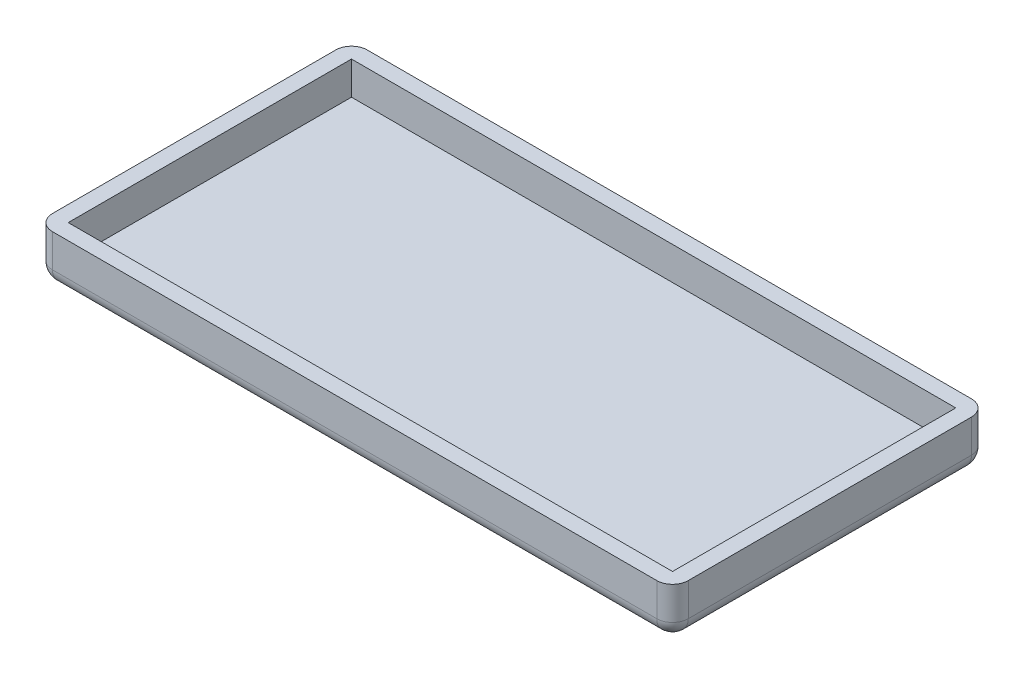
ISO-10303-21;
HEADER;
FILE_DESCRIPTION(('STEP AP214'),'2;1');
FILE_NAME('part.step','',(''),(''),'','','');
FILE_SCHEMA(('AUTOMOTIVE_DESIGN { 1 0 10303 214 1 1 1 1 }'));
ENDSEC;
DATA;
#1=APPLICATION_CONTEXT('core data for automotive mechanical design processes');
#2=APPLICATION_PROTOCOL_DEFINITION('international standard','automotive_design',2000,#1);
#3=PRODUCT_CONTEXT('',#1,'mechanical');
#4=PRODUCT('Part','Part','',(#3));
#5=PRODUCT_RELATED_PRODUCT_CATEGORY('part','',(#4));
#6=PRODUCT_DEFINITION_FORMATION('','',#4);
#7=PRODUCT_DEFINITION_CONTEXT('part definition',#1,'design');
#8=PRODUCT_DEFINITION('design','',#6,#7);
#9=PRODUCT_DEFINITION_SHAPE('','',#8);
#10=(LENGTH_UNIT() NAMED_UNIT(*) SI_UNIT(.MILLI.,.METRE.));
#11=(NAMED_UNIT(*) PLANE_ANGLE_UNIT() SI_UNIT($,.RADIAN.));
#12=(NAMED_UNIT(*) SI_UNIT($,.STERADIAN.) SOLID_ANGLE_UNIT());
#13=UNCERTAINTY_MEASURE_WITH_UNIT(LENGTH_MEASURE(1.E-05),#10,'distance_accuracy_value','');
#14=(GEOMETRIC_REPRESENTATION_CONTEXT(3) GLOBAL_UNCERTAINTY_ASSIGNED_CONTEXT((#13)) GLOBAL_UNIT_ASSIGNED_CONTEXT((#10,
#11,#12)) REPRESENTATION_CONTEXT('',''));
#15=CARTESIAN_POINT('',(0.,0.,0.));
#16=DIRECTION('',(0.,0.,1.));
#17=DIRECTION('',(1.,0.,0.));
#18=AXIS2_PLACEMENT_3D('',#15,#16,#17);
#19=CARTESIAN_POINT('',(-25.5813953488372,1.,-10.));
#20=DIRECTION('',(1.,0.,0.));
#21=DIRECTION('',(0.,0.,-1.));
#22=AXIS2_PLACEMENT_3D('',#19,#20,#21);
#23=PLANE('',#22);
#24=DIRECTION('',(0.,0.,1.));
#25=VECTOR('',#24,1.);
#26=CARTESIAN_POINT('',(-25.5813953488372,3.1,-10.));
#27=LINE('',#26,#25);
#28=CARTESIAN_POINT('',(-25.5813953488372,3.1,-9.));
#29=VERTEX_POINT('',#28);
#30=CARTESIAN_POINT('',(-25.5813953488372,3.1,9.));
#31=VERTEX_POINT('',#30);
#32=EDGE_CURVE('E152',#29,#31,#27,.T.);
#33=ORIENTED_EDGE('',*,*,#32,.F.);
#34=DIRECTION('',(0.,-1.,0.));
#35=VECTOR('',#34,1.);
#36=CARTESIAN_POINT('',(-25.5813953488372,1.,-9.));
#37=LINE('',#36,#35);
#38=CARTESIAN_POINT('',(-25.5813953488372,1.,-9.));
#39=VERTEX_POINT('',#38);
#40=EDGE_CURVE('E191',#29,#39,#37,.T.);
#41=ORIENTED_EDGE('',*,*,#40,.T.);
#42=DIRECTION('',(0.,0.,1.));
#43=VECTOR('',#42,1.);
#44=CARTESIAN_POINT('',(-25.5813953488372,1.,-10.));
#45=LINE('',#44,#43);
#46=CARTESIAN_POINT('',(-25.5813953488372,1.,9.));
#47=VERTEX_POINT('',#46);
#48=EDGE_CURVE('E188',#39,#47,#45,.T.);
#49=ORIENTED_EDGE('',*,*,#48,.T.);
#50=DIRECTION('',(0.,-1.,0.));
#51=VECTOR('',#50,1.);
#52=CARTESIAN_POINT('',(-25.5813953488372,1.,9.));
#53=LINE('',#52,#51);
#54=EDGE_CURVE('E186',#47,#31,#53,.F.);
#55=ORIENTED_EDGE('',*,*,#54,.T.);
#56=EDGE_LOOP('',(#33,#41,#49,#55));
#57=FACE_BOUND('',#56,.T.);
#58=ADVANCED_FACE('F32',(#57),#23,.F.);
#59=CARTESIAN_POINT('',(-25.5813953488372,1.,10.));
#60=DIRECTION('',(0.,0.,-1.));
#61=DIRECTION('',(-1.,0.,0.));
#62=AXIS2_PLACEMENT_3D('',#59,#60,#61);
#63=PLANE('',#62);
#64=DIRECTION('',(1.,0.,0.));
#65=VECTOR('',#64,1.);
#66=CARTESIAN_POINT('',(-25.5813953488372,1.,10.));
#67=LINE('',#66,#65);
#68=CARTESIAN_POINT('',(-24.5813953488372,1.,10.));
#69=VERTEX_POINT('',#68);
#70=CARTESIAN_POINT('',(13.8186046511628,1.,10.));
#71=VERTEX_POINT('',#70);
#72=EDGE_CURVE('E41',#69,#71,#67,.T.);
#73=ORIENTED_EDGE('',*,*,#72,.T.);
#74=DIRECTION('',(0.,-1.,0.));
#75=VECTOR('',#74,1.);
#76=CARTESIAN_POINT('',(13.8186046511628,1.,10.));
#77=LINE('',#76,#75);
#78=CARTESIAN_POINT('',(13.8186046511628,3.1,10.));
#79=VERTEX_POINT('',#78);
#80=EDGE_CURVE('E11',#71,#79,#77,.F.);
#81=ORIENTED_EDGE('',*,*,#80,.T.);
#82=DIRECTION('',(1.,0.,0.));
#83=VECTOR('',#82,1.);
#84=CARTESIAN_POINT('',(-25.5813953488372,3.1,10.));
#85=LINE('',#84,#83);
#86=CARTESIAN_POINT('',(-24.5813953488372,3.1,10.));
#87=VERTEX_POINT('',#86);
#88=EDGE_CURVE('E177',#87,#79,#85,.T.);
#89=ORIENTED_EDGE('',*,*,#88,.F.);
#90=DIRECTION('',(0.,-1.,0.));
#91=VECTOR('',#90,1.);
#92=CARTESIAN_POINT('',(-24.5813953488372,1.,10.));
#93=LINE('',#92,#91);
#94=EDGE_CURVE('E52',#87,#69,#93,.T.);
#95=ORIENTED_EDGE('',*,*,#94,.T.);
#96=EDGE_LOOP('',(#73,#81,#89,#95));
#97=FACE_BOUND('',#96,.T.);
#98=ADVANCED_FACE('F288',(#97),#63,.F.);
#99=CARTESIAN_POINT('',(14.8186046511628,1.,-10.));
#100=DIRECTION('',(-1.,0.,0.));
#101=DIRECTION('',(0.,0.,1.));
#102=AXIS2_PLACEMENT_3D('',#99,#100,#101);
#103=PLANE('',#102);
#104=DIRECTION('',(0.,0.,-1.));
#105=VECTOR('',#104,1.);
#106=CARTESIAN_POINT('',(14.8186046511628,1.,-10.));
#107=LINE('',#106,#105);
#108=CARTESIAN_POINT('',(14.8186046511628,1.,9.));
#109=VERTEX_POINT('',#108);
#110=CARTESIAN_POINT('',(14.8186046511628,1.,-9.));
#111=VERTEX_POINT('',#110);
#112=EDGE_CURVE('E218',#109,#111,#107,.T.);
#113=ORIENTED_EDGE('',*,*,#112,.T.);
#114=DIRECTION('',(0.,-1.,0.));
#115=VECTOR('',#114,1.);
#116=CARTESIAN_POINT('',(14.8186046511628,1.,-9.));
#117=LINE('',#116,#115);
#118=CARTESIAN_POINT('',(14.8186046511628,3.1,-9.));
#119=VERTEX_POINT('',#118);
#120=EDGE_CURVE('E220',#111,#119,#117,.F.);
#121=ORIENTED_EDGE('',*,*,#120,.T.);
#122=DIRECTION('',(0.,0.,-1.));
#123=VECTOR('',#122,1.);
#124=CARTESIAN_POINT('',(14.8186046511628,3.1,-10.));
#125=LINE('',#124,#123);
#126=CARTESIAN_POINT('',(14.8186046511628,3.1,9.));
#127=VERTEX_POINT('',#126);
#128=EDGE_CURVE('E180',#127,#119,#125,.T.);
#129=ORIENTED_EDGE('',*,*,#128,.F.);
#130=DIRECTION('',(0.,-1.,0.));
#131=VECTOR('',#130,1.);
#132=CARTESIAN_POINT('',(14.8186046511628,1.,9.));
#133=LINE('',#132,#131);
#134=EDGE_CURVE('E216',#127,#109,#133,.T.);
#135=ORIENTED_EDGE('',*,*,#134,.T.);
#136=EDGE_LOOP('',(#113,#121,#129,#135));
#137=FACE_BOUND('',#136,.T.);
#138=ADVANCED_FACE('F307',(#137),#103,.F.);
#139=CARTESIAN_POINT('',(-25.5813953488372,1.,-10.));
#140=DIRECTION('',(0.,0.,1.));
#141=DIRECTION('',(1.,0.,0.));
#142=AXIS2_PLACEMENT_3D('',#139,#140,#141);
#143=PLANE('',#142);
#144=DIRECTION('',(-1.,0.,0.));
#145=VECTOR('',#144,1.);
#146=CARTESIAN_POINT('',(-25.5813953488372,1.,-10.));
#147=LINE('',#146,#145);
#148=CARTESIAN_POINT('',(13.8186046511628,1.,-10.));
#149=VERTEX_POINT('',#148);
#150=CARTESIAN_POINT('',(-24.5813953488372,1.,-10.));
#151=VERTEX_POINT('',#150);
#152=EDGE_CURVE('E204',#149,#151,#147,.T.);
#153=ORIENTED_EDGE('',*,*,#152,.T.);
#154=DIRECTION('',(0.,-1.,0.));
#155=VECTOR('',#154,1.);
#156=CARTESIAN_POINT('',(-24.5813953488372,1.,-10.));
#157=LINE('',#156,#155);
#158=CARTESIAN_POINT('',(-24.5813953488372,3.1,-10.));
#159=VERTEX_POINT('',#158);
#160=EDGE_CURVE('E206',#151,#159,#157,.F.);
#161=ORIENTED_EDGE('',*,*,#160,.T.);
#162=DIRECTION('',(-1.,0.,0.));
#163=VECTOR('',#162,1.);
#164=CARTESIAN_POINT('',(-25.5813953488372,3.1,-10.));
#165=LINE('',#164,#163);
#166=CARTESIAN_POINT('',(13.8186046511628,3.1,-10.));
#167=VERTEX_POINT('',#166);
#168=EDGE_CURVE('E183',#167,#159,#165,.T.);
#169=ORIENTED_EDGE('',*,*,#168,.F.);
#170=DIRECTION('',(0.,-1.,0.));
#171=VECTOR('',#170,1.);
#172=CARTESIAN_POINT('',(13.8186046511628,1.,-10.));
#173=LINE('',#172,#171);
#174=EDGE_CURVE('E202',#167,#149,#173,.T.);
#175=ORIENTED_EDGE('',*,*,#174,.T.);
#176=EDGE_LOOP('',(#153,#161,#169,#175));
#177=FACE_BOUND('',#176,.T.);
#178=ADVANCED_FACE('F269',(#177),#143,.F.);
#179=CARTESIAN_POINT('',(0.,0.,0.));
#180=DIRECTION('',(0.,1.,0.));
#181=DIRECTION('',(0.,0.,1.));
#182=AXIS2_PLACEMENT_3D('',#179,#180,#181);
#183=PLANE('',#182);
#184=DIRECTION('',(1.,0.,0.));
#185=VECTOR('',#184,1.);
#186=CARTESIAN_POINT('',(0.,0.,9.));
#187=LINE('',#186,#185);
#188=CARTESIAN_POINT('',(13.8186046511628,0.,9.));
#189=VERTEX_POINT('',#188);
#190=CARTESIAN_POINT('',(-24.5813953488372,0.,9.));
#191=VERTEX_POINT('',#190);
#192=EDGE_CURVE('E193',#189,#191,#187,.F.);
#193=ORIENTED_EDGE('',*,*,#192,.T.);
#194=DIRECTION('',(0.,0.,1.));
#195=VECTOR('',#194,1.);
#196=CARTESIAN_POINT('',(-24.5813953488372,0.,0.));
#197=LINE('',#196,#195);
#198=CARTESIAN_POINT('',(-24.5813953488372,0.,-9.));
#199=VERTEX_POINT('',#198);
#200=EDGE_CURVE('E199',#191,#199,#197,.F.);
#201=ORIENTED_EDGE('',*,*,#200,.T.);
#202=DIRECTION('',(-1.,0.,0.));
#203=VECTOR('',#202,1.);
#204=CARTESIAN_POINT('',(0.,0.,-9.));
#205=LINE('',#204,#203);
#206=CARTESIAN_POINT('',(13.8186046511628,0.,-9.));
#207=VERTEX_POINT('',#206);
#208=EDGE_CURVE('E197',#199,#207,#205,.F.);
#209=ORIENTED_EDGE('',*,*,#208,.T.);
#210=DIRECTION('',(0.,0.,-1.));
#211=VECTOR('',#210,1.);
#212=CARTESIAN_POINT('',(13.8186046511628,0.,0.));
#213=LINE('',#212,#211);
#214=EDGE_CURVE('E195',#207,#189,#213,.F.);
#215=ORIENTED_EDGE('',*,*,#214,.T.);
#216=EDGE_LOOP('',(#193,#201,#209,#215));
#217=FACE_BOUND('',#216,.T.);
#218=ADVANCED_FACE('F303',(#217),#183,.F.);
#219=CARTESIAN_POINT('',(0.,3.1,0.));
#220=DIRECTION('',(0.,1.,0.));
#221=DIRECTION('',(0.,0.,1.));
#222=AXIS2_PLACEMENT_3D('',#219,#220,#221);
#223=PLANE('',#222);
#224=ORIENTED_EDGE('',*,*,#168,.T.);
#225=CARTESIAN_POINT('',(-24.5813953488372,3.1,-9.));
#226=DIRECTION('',(0.,1.,0.));
#227=DIRECTION('',(0.,0.,1.));
#228=AXIS2_PLACEMENT_3D('',#225,#226,#227);
#229=CIRCLE('',#228,1.);
#230=EDGE_CURVE('E214',#159,#29,#229,.T.);
#231=ORIENTED_EDGE('',*,*,#230,.T.);
#232=ORIENTED_EDGE('',*,*,#32,.T.);
#233=CARTESIAN_POINT('',(-24.5813953488372,3.1,9.));
#234=DIRECTION('',(0.,1.,0.));
#235=DIRECTION('',(0.,0.,1.));
#236=AXIS2_PLACEMENT_3D('',#233,#234,#235);
#237=CIRCLE('',#236,1.);
#238=EDGE_CURVE('E208',#31,#87,#237,.T.);
#239=ORIENTED_EDGE('',*,*,#238,.T.);
#240=ORIENTED_EDGE('',*,*,#88,.T.);
#241=CARTESIAN_POINT('',(13.8186046511628,3.1,9.));
#242=DIRECTION('',(0.,1.,0.));
#243=DIRECTION('',(0.,0.,1.));
#244=AXIS2_PLACEMENT_3D('',#241,#242,#243);
#245=CIRCLE('',#244,1.);
#246=EDGE_CURVE('E210',#79,#127,#245,.T.);
#247=ORIENTED_EDGE('',*,*,#246,.T.);
#248=ORIENTED_EDGE('',*,*,#128,.T.);
#249=CARTESIAN_POINT('',(13.8186046511628,3.1,-9.));
#250=DIRECTION('',(0.,1.,0.));
#251=DIRECTION('',(0.,0.,1.));
#252=AXIS2_PLACEMENT_3D('',#249,#250,#251);
#253=CIRCLE('',#252,1.);
#254=EDGE_CURVE('E212',#119,#167,#253,.T.);
#255=ORIENTED_EDGE('',*,*,#254,.T.);
#256=EDGE_LOOP('',(#224,#231,#232,#239,#240,#247,#248,#255));
#257=FACE_BOUND('',#256,.T.);
#258=DIRECTION('',(1.,0.,0.));
#259=VECTOR('',#258,1.);
#260=CARTESIAN_POINT('',(-24.5813953488372,3.1,9.));
#261=LINE('',#260,#259);
#262=CARTESIAN_POINT('',(-24.5813953488372,3.1,9.));
#263=VERTEX_POINT('',#262);
#264=CARTESIAN_POINT('',(13.8186046511628,3.1,9.));
#265=VERTEX_POINT('',#264);
#266=EDGE_CURVE('E143',#263,#265,#261,.T.);
#267=ORIENTED_EDGE('',*,*,#266,.F.);
#268=DIRECTION('',(0.,0.,1.));
#269=VECTOR('',#268,1.);
#270=CARTESIAN_POINT('',(-24.5813953488372,3.1,-9.));
#271=LINE('',#270,#269);
#272=CARTESIAN_POINT('',(-24.5813953488372,3.1,-9.));
#273=VERTEX_POINT('',#272);
#274=EDGE_CURVE('E133',#273,#263,#271,.T.);
#275=ORIENTED_EDGE('',*,*,#274,.F.);
#276=DIRECTION('',(-1.,0.,0.));
#277=VECTOR('',#276,1.);
#278=CARTESIAN_POINT('',(-24.5813953488372,3.1,-9.));
#279=LINE('',#278,#277);
#280=CARTESIAN_POINT('',(13.8186046511628,3.1,-9.));
#281=VERTEX_POINT('',#280);
#282=EDGE_CURVE('E160',#281,#273,#279,.T.);
#283=ORIENTED_EDGE('',*,*,#282,.F.);
#284=DIRECTION('',(0.,0.,-1.));
#285=VECTOR('',#284,1.);
#286=CARTESIAN_POINT('',(13.8186046511628,3.1,-9.));
#287=LINE('',#286,#285);
#288=EDGE_CURVE('E158',#265,#281,#287,.T.);
#289=ORIENTED_EDGE('',*,*,#288,.F.);
#290=EDGE_LOOP('',(#267,#275,#283,#289));
#291=FACE_BOUND('',#290,.T.);
#292=ADVANCED_FACE('F156',(#257,#291),#223,.T.);
#293=CARTESIAN_POINT('',(-24.5813953488372,3.1,-9.));
#294=DIRECTION('',(1.,0.,0.));
#295=DIRECTION('',(0.,0.,-1.));
#296=AXIS2_PLACEMENT_3D('',#293,#294,#295);
#297=PLANE('',#296);
#298=DIRECTION('',(0.,0.,1.));
#299=VECTOR('',#298,1.);
#300=CARTESIAN_POINT('',(-24.5813953488372,1.,-9.));
#301=LINE('',#300,#299);
#302=CARTESIAN_POINT('',(-24.5813953488372,1.,-9.));
#303=VERTEX_POINT('',#302);
#304=CARTESIAN_POINT('',(-24.5813953488372,1.,9.));
#305=VERTEX_POINT('',#304);
#306=EDGE_CURVE('E164',#303,#305,#301,.T.);
#307=ORIENTED_EDGE('',*,*,#306,.F.);
#308=DIRECTION('',(0.,-1.,0.));
#309=VECTOR('',#308,1.);
#310=CARTESIAN_POINT('',(-24.5813953488372,3.1,-9.));
#311=LINE('',#310,#309);
#312=EDGE_CURVE('E139',#273,#303,#311,.T.);
#313=ORIENTED_EDGE('',*,*,#312,.F.);
#314=ORIENTED_EDGE('',*,*,#274,.T.);
#315=DIRECTION('',(0.,-1.,0.));
#316=VECTOR('',#315,1.);
#317=CARTESIAN_POINT('',(-24.5813953488372,3.1,9.));
#318=LINE('',#317,#316);
#319=EDGE_CURVE('E137',#263,#305,#318,.T.);
#320=ORIENTED_EDGE('',*,*,#319,.T.);
#321=EDGE_LOOP('',(#307,#313,#314,#320));
#322=FACE_BOUND('',#321,.T.);
#323=ADVANCED_FACE('F136',(#322),#297,.T.);
#324=CARTESIAN_POINT('',(-24.5813953488372,3.1,9.));
#325=DIRECTION('',(0.,0.,-1.));
#326=DIRECTION('',(-1.,0.,0.));
#327=AXIS2_PLACEMENT_3D('',#324,#325,#326);
#328=PLANE('',#327);
#329=DIRECTION('',(1.,0.,0.));
#330=VECTOR('',#329,1.);
#331=CARTESIAN_POINT('',(-24.5813953488372,1.,9.));
#332=LINE('',#331,#330);
#333=CARTESIAN_POINT('',(13.8186046511628,1.,9.));
#334=VERTEX_POINT('',#333);
#335=EDGE_CURVE('E151',#305,#334,#332,.T.);
#336=ORIENTED_EDGE('',*,*,#335,.F.);
#337=ORIENTED_EDGE('',*,*,#319,.F.);
#338=ORIENTED_EDGE('',*,*,#266,.T.);
#339=DIRECTION('',(0.,-1.,0.));
#340=VECTOR('',#339,1.);
#341=CARTESIAN_POINT('',(13.8186046511628,3.1,9.));
#342=LINE('',#341,#340);
#343=EDGE_CURVE('E153',#265,#334,#342,.T.);
#344=ORIENTED_EDGE('',*,*,#343,.T.);
#345=EDGE_LOOP('',(#336,#337,#338,#344));
#346=FACE_BOUND('',#345,.T.);
#347=ADVANCED_FACE('F148',(#346),#328,.T.);
#348=CARTESIAN_POINT('',(13.8186046511628,3.1,-9.));
#349=DIRECTION('',(-1.,0.,0.));
#350=DIRECTION('',(0.,0.,1.));
#351=AXIS2_PLACEMENT_3D('',#348,#349,#350);
#352=PLANE('',#351);
#353=DIRECTION('',(0.,0.,-1.));
#354=VECTOR('',#353,1.);
#355=CARTESIAN_POINT('',(13.8186046511628,1.,-9.));
#356=LINE('',#355,#354);
#357=CARTESIAN_POINT('',(13.8186046511628,1.,-9.));
#358=VERTEX_POINT('',#357);
#359=EDGE_CURVE('E167',#334,#358,#356,.T.);
#360=ORIENTED_EDGE('',*,*,#359,.F.);
#361=ORIENTED_EDGE('',*,*,#343,.F.);
#362=ORIENTED_EDGE('',*,*,#288,.T.);
#363=DIRECTION('',(0.,-1.,0.));
#364=VECTOR('',#363,1.);
#365=CARTESIAN_POINT('',(13.8186046511628,3.1,-9.));
#366=LINE('',#365,#364);
#367=EDGE_CURVE('E171',#281,#358,#366,.T.);
#368=ORIENTED_EDGE('',*,*,#367,.T.);
#369=EDGE_LOOP('',(#360,#361,#362,#368));
#370=FACE_BOUND('',#369,.T.);
#371=ADVANCED_FACE('F430',(#370),#352,.T.);
#372=CARTESIAN_POINT('',(-24.5813953488372,3.1,-9.));
#373=DIRECTION('',(0.,0.,1.));
#374=DIRECTION('',(1.,0.,0.));
#375=AXIS2_PLACEMENT_3D('',#372,#373,#374);
#376=PLANE('',#375);
#377=DIRECTION('',(-1.,0.,0.));
#378=VECTOR('',#377,1.);
#379=CARTESIAN_POINT('',(-24.5813953488372,1.,-9.));
#380=LINE('',#379,#378);
#381=EDGE_CURVE('E144',#358,#303,#380,.T.);
#382=ORIENTED_EDGE('',*,*,#381,.F.);
#383=ORIENTED_EDGE('',*,*,#367,.F.);
#384=ORIENTED_EDGE('',*,*,#282,.T.);
#385=ORIENTED_EDGE('',*,*,#312,.T.);
#386=EDGE_LOOP('',(#382,#383,#384,#385));
#387=FACE_BOUND('',#386,.T.);
#388=ADVANCED_FACE('F317',(#387),#376,.T.);
#389=CARTESIAN_POINT('',(0.,1.,0.));
#390=DIRECTION('',(0.,1.,0.));
#391=DIRECTION('',(0.,0.,1.));
#392=AXIS2_PLACEMENT_3D('',#389,#390,#391);
#393=PLANE('',#392);
#394=ORIENTED_EDGE('',*,*,#306,.T.);
#395=ORIENTED_EDGE('',*,*,#335,.T.);
#396=ORIENTED_EDGE('',*,*,#359,.T.);
#397=ORIENTED_EDGE('',*,*,#381,.T.);
#398=EDGE_LOOP('',(#394,#395,#396,#397));
#399=FACE_BOUND('',#398,.T.);
#400=ADVANCED_FACE('F312',(#399),#393,.T.);
#401=CARTESIAN_POINT('',(13.8186046511628,1.,-9.));
#402=DIRECTION('',(0.,-1.,0.));
#403=DIRECTION('',(0.,0.,-1.));
#404=AXIS2_PLACEMENT_3D('',#401,#402,#403);
#405=CYLINDRICAL_SURFACE('',#404,1.);
#406=ORIENTED_EDGE('',*,*,#254,.F.);
#407=ORIENTED_EDGE('',*,*,#120,.F.);
#408=CARTESIAN_POINT('',(13.8186046511628,1.,-9.));
#409=DIRECTION('',(0.,-1.,0.));
#410=DIRECTION('',(0.,0.,-1.));
#411=AXIS2_PLACEMENT_3D('',#408,#409,#410);
#412=CIRCLE('',#411,1.);
#413=EDGE_CURVE('E251',#149,#111,#412,.T.);
#414=ORIENTED_EDGE('',*,*,#413,.F.);
#415=ORIENTED_EDGE('',*,*,#174,.F.);
#416=EDGE_LOOP('',(#406,#407,#414,#415));
#417=FACE_BOUND('',#416,.T.);
#418=ADVANCED_FACE('F34',(#417),#405,.T.);
#419=CARTESIAN_POINT('',(13.8186046511628,1.,9.));
#420=DIRECTION('',(0.,-1.,0.));
#421=DIRECTION('',(0.,0.,-1.));
#422=AXIS2_PLACEMENT_3D('',#419,#420,#421);
#423=CYLINDRICAL_SURFACE('',#422,1.);
#424=ORIENTED_EDGE('',*,*,#246,.F.);
#425=ORIENTED_EDGE('',*,*,#80,.F.);
#426=CARTESIAN_POINT('',(13.8186046511628,1.,9.));
#427=DIRECTION('',(0.,-1.,0.));
#428=DIRECTION('',(0.,0.,-1.));
#429=AXIS2_PLACEMENT_3D('',#426,#427,#428);
#430=CIRCLE('',#429,1.);
#431=EDGE_CURVE('E249',#109,#71,#430,.T.);
#432=ORIENTED_EDGE('',*,*,#431,.F.);
#433=ORIENTED_EDGE('',*,*,#134,.F.);
#434=EDGE_LOOP('',(#424,#425,#432,#433));
#435=FACE_BOUND('',#434,.T.);
#436=ADVANCED_FACE('F291',(#435),#423,.T.);
#437=CARTESIAN_POINT('',(13.8186046511628,1.,-10.));
#438=DIRECTION('',(0.,0.,-1.));
#439=DIRECTION('',(-1.,0.,0.));
#440=AXIS2_PLACEMENT_3D('',#437,#438,#439);
#441=CYLINDRICAL_SURFACE('',#440,1.);
#442=CARTESIAN_POINT('',(13.8186046511628,1.,-9.));
#443=DIRECTION('',(0.,0.,-1.));
#444=DIRECTION('',(-1.,0.,0.));
#445=AXIS2_PLACEMENT_3D('',#442,#443,#444);
#446=CIRCLE('',#445,1.);
#447=EDGE_CURVE('E36',#111,#207,#446,.T.);
#448=ORIENTED_EDGE('',*,*,#447,.F.);
#449=ORIENTED_EDGE('',*,*,#112,.F.);
#450=CARTESIAN_POINT('',(13.8186046511628,1.,9.));
#451=DIRECTION('',(0.,0.,1.));
#452=DIRECTION('',(1.,0.,0.));
#453=AXIS2_PLACEMENT_3D('',#450,#451,#452);
#454=CIRCLE('',#453,1.);
#455=EDGE_CURVE('E246',#189,#109,#454,.T.);
#456=ORIENTED_EDGE('',*,*,#455,.F.);
#457=ORIENTED_EDGE('',*,*,#214,.F.);
#458=EDGE_LOOP('',(#448,#449,#456,#457));
#459=FACE_BOUND('',#458,.T.);
#460=ADVANCED_FACE('F304',(#459),#441,.T.);
#461=CARTESIAN_POINT('',(13.8186046511628,1.,-9.));
#462=DIRECTION('',(0.,0.,1.));
#463=DIRECTION('',(1.,0.,0.));
#464=AXIS2_PLACEMENT_3D('',#461,#462,#463);
#465=SPHERICAL_SURFACE('',#464,1.);
#466=ORIENTED_EDGE('',*,*,#413,.T.);
#467=ORIENTED_EDGE('',*,*,#447,.T.);
#468=CARTESIAN_POINT('',(13.8186046511628,1.,-9.));
#469=DIRECTION('',(1.,0.,0.));
#470=DIRECTION('',(0.,0.,-1.));
#471=AXIS2_PLACEMENT_3D('',#468,#469,#470);
#472=CIRCLE('',#471,1.);
#473=EDGE_CURVE('E243',#149,#207,#472,.F.);
#474=ORIENTED_EDGE('',*,*,#473,.F.);
#475=EDGE_LOOP('',(#466,#467,#474));
#476=FACE_BOUND('',#475,.T.);
#477=ADVANCED_FACE('F258',(#476),#465,.T.);
#478=CARTESIAN_POINT('',(13.8186046511628,1.,9.));
#479=DIRECTION('',(0.,0.,1.));
#480=DIRECTION('',(1.,0.,0.));
#481=AXIS2_PLACEMENT_3D('',#478,#479,#480);
#482=SPHERICAL_SURFACE('',#481,1.);
#483=ORIENTED_EDGE('',*,*,#455,.T.);
#484=ORIENTED_EDGE('',*,*,#431,.T.);
#485=CARTESIAN_POINT('',(13.8186046511628,1.,9.));
#486=DIRECTION('',(1.,0.,0.));
#487=DIRECTION('',(0.,0.,-1.));
#488=AXIS2_PLACEMENT_3D('',#485,#486,#487);
#489=CIRCLE('',#488,1.);
#490=EDGE_CURVE('E240',#189,#71,#489,.F.);
#491=ORIENTED_EDGE('',*,*,#490,.F.);
#492=EDGE_LOOP('',(#483,#484,#491));
#493=FACE_BOUND('',#492,.T.);
#494=ADVANCED_FACE('F295',(#493),#482,.T.);
#495=CARTESIAN_POINT('',(-25.5813953488372,1.,-9.));
#496=DIRECTION('',(-1.,0.,0.));
#497=DIRECTION('',(0.,0.,1.));
#498=AXIS2_PLACEMENT_3D('',#495,#496,#497);
#499=CYLINDRICAL_SURFACE('',#498,1.);
#500=ORIENTED_EDGE('',*,*,#473,.T.);
#501=ORIENTED_EDGE('',*,*,#208,.F.);
#502=CARTESIAN_POINT('',(-24.5813953488372,1.,-9.));
#503=DIRECTION('',(-1.,0.,0.));
#504=DIRECTION('',(0.,0.,1.));
#505=AXIS2_PLACEMENT_3D('',#502,#503,#504);
#506=CIRCLE('',#505,1.);
#507=EDGE_CURVE('E237',#151,#199,#506,.T.);
#508=ORIENTED_EDGE('',*,*,#507,.F.);
#509=ORIENTED_EDGE('',*,*,#152,.F.);
#510=EDGE_LOOP('',(#500,#501,#508,#509));
#511=FACE_BOUND('',#510,.T.);
#512=ADVANCED_FACE('F265',(#511),#499,.T.);
#513=CARTESIAN_POINT('',(-24.5813953488372,1.,-9.));
#514=DIRECTION('',(0.,-1.,0.));
#515=DIRECTION('',(0.,0.,-1.));
#516=AXIS2_PLACEMENT_3D('',#513,#514,#515);
#517=CYLINDRICAL_SURFACE('',#516,1.);
#518=ORIENTED_EDGE('',*,*,#230,.F.);
#519=ORIENTED_EDGE('',*,*,#160,.F.);
#520=CARTESIAN_POINT('',(-24.5813953488372,1.,-9.));
#521=DIRECTION('',(0.,-1.,0.));
#522=DIRECTION('',(0.,0.,-1.));
#523=AXIS2_PLACEMENT_3D('',#520,#521,#522);
#524=CIRCLE('',#523,1.);
#525=EDGE_CURVE('E234',#39,#151,#524,.T.);
#526=ORIENTED_EDGE('',*,*,#525,.F.);
#527=ORIENTED_EDGE('',*,*,#40,.F.);
#528=EDGE_LOOP('',(#518,#519,#526,#527));
#529=FACE_BOUND('',#528,.T.);
#530=ADVANCED_FACE('F275',(#529),#517,.T.);
#531=CARTESIAN_POINT('',(-24.5813953488372,1.,9.));
#532=DIRECTION('',(0.,-1.,0.));
#533=DIRECTION('',(0.,0.,-1.));
#534=AXIS2_PLACEMENT_3D('',#531,#532,#533);
#535=CYLINDRICAL_SURFACE('',#534,1.);
#536=ORIENTED_EDGE('',*,*,#238,.F.);
#537=ORIENTED_EDGE('',*,*,#54,.F.);
#538=CARTESIAN_POINT('',(-24.5813953488372,1.,9.));
#539=DIRECTION('',(0.,-1.,0.));
#540=DIRECTION('',(0.,0.,-1.));
#541=AXIS2_PLACEMENT_3D('',#538,#539,#540);
#542=CIRCLE('',#541,1.);
#543=EDGE_CURVE('E231',#69,#47,#542,.T.);
#544=ORIENTED_EDGE('',*,*,#543,.F.);
#545=ORIENTED_EDGE('',*,*,#94,.F.);
#546=EDGE_LOOP('',(#536,#537,#544,#545));
#547=FACE_BOUND('',#546,.T.);
#548=ADVANCED_FACE('F286',(#547),#535,.T.);
#549=CARTESIAN_POINT('',(-25.5813953488372,1.,9.));
#550=DIRECTION('',(1.,0.,0.));
#551=DIRECTION('',(0.,0.,-1.));
#552=AXIS2_PLACEMENT_3D('',#549,#550,#551);
#553=CYLINDRICAL_SURFACE('',#552,1.);
#554=ORIENTED_EDGE('',*,*,#490,.T.);
#555=ORIENTED_EDGE('',*,*,#72,.F.);
#556=CARTESIAN_POINT('',(-24.5813953488372,1.,9.));
#557=DIRECTION('',(-1.,0.,0.));
#558=DIRECTION('',(0.,0.,1.));
#559=AXIS2_PLACEMENT_3D('',#556,#557,#558);
#560=CIRCLE('',#559,1.);
#561=EDGE_CURVE('E228',#191,#69,#560,.T.);
#562=ORIENTED_EDGE('',*,*,#561,.F.);
#563=ORIENTED_EDGE('',*,*,#192,.F.);
#564=EDGE_LOOP('',(#554,#555,#562,#563));
#565=FACE_BOUND('',#564,.T.);
#566=ADVANCED_FACE('F299',(#565),#553,.T.);
#567=CARTESIAN_POINT('',(-24.5813953488372,1.,-9.));
#568=DIRECTION('',(0.,0.,1.));
#569=DIRECTION('',(1.,0.,0.));
#570=AXIS2_PLACEMENT_3D('',#567,#568,#569);
#571=SPHERICAL_SURFACE('',#570,1.);
#572=ORIENTED_EDGE('',*,*,#525,.T.);
#573=ORIENTED_EDGE('',*,*,#507,.T.);
#574=CARTESIAN_POINT('',(-24.5813953488372,1.,-9.));
#575=DIRECTION('',(0.,0.,-1.));
#576=DIRECTION('',(-1.,0.,0.));
#577=AXIS2_PLACEMENT_3D('',#574,#575,#576);
#578=CIRCLE('',#577,1.);
#579=EDGE_CURVE('E226',#39,#199,#578,.F.);
#580=ORIENTED_EDGE('',*,*,#579,.F.);
#581=EDGE_LOOP('',(#572,#573,#580));
#582=FACE_BOUND('',#581,.T.);
#583=ADVANCED_FACE('F335',(#582),#571,.T.);
#584=CARTESIAN_POINT('',(-24.5813953488372,1.,9.));
#585=DIRECTION('',(0.,0.,1.));
#586=DIRECTION('',(1.,0.,0.));
#587=AXIS2_PLACEMENT_3D('',#584,#585,#586);
#588=SPHERICAL_SURFACE('',#587,1.);
#589=ORIENTED_EDGE('',*,*,#561,.T.);
#590=ORIENTED_EDGE('',*,*,#543,.T.);
#591=CARTESIAN_POINT('',(-24.5813953488372,1.,9.));
#592=DIRECTION('',(0.,0.,1.));
#593=DIRECTION('',(1.,0.,0.));
#594=AXIS2_PLACEMENT_3D('',#591,#592,#593);
#595=CIRCLE('',#594,1.);
#596=EDGE_CURVE('E224',#191,#47,#595,.F.);
#597=ORIENTED_EDGE('',*,*,#596,.F.);
#598=EDGE_LOOP('',(#589,#590,#597));
#599=FACE_BOUND('',#598,.T.);
#600=ADVANCED_FACE('F331',(#599),#588,.T.);
#601=CARTESIAN_POINT('',(-24.5813953488372,1.,-10.));
#602=DIRECTION('',(0.,0.,1.));
#603=DIRECTION('',(1.,0.,0.));
#604=AXIS2_PLACEMENT_3D('',#601,#602,#603);
#605=CYLINDRICAL_SURFACE('',#604,1.);
#606=ORIENTED_EDGE('',*,*,#579,.T.);
#607=ORIENTED_EDGE('',*,*,#200,.F.);
#608=ORIENTED_EDGE('',*,*,#596,.T.);
#609=ORIENTED_EDGE('',*,*,#48,.F.);
#610=EDGE_LOOP('',(#606,#607,#608,#609));
#611=FACE_BOUND('',#610,.T.);
#612=ADVANCED_FACE('F328',(#611),#605,.T.);
#613=CLOSED_SHELL('',(#58,#98,#138,#178,#218,#292,#323,#347,#371,#388,#400,#418,#436,#460,#477,
#494,#512,#530,#548,#566,#583,#600,#612));
#614=MANIFOLD_SOLID_BREP('B2',#613);
#615=ADVANCED_BREP_SHAPE_REPRESENTATION('',(#18,#614),#14);
#616=SHAPE_DEFINITION_REPRESENTATION(#9,#615);
ENDSEC;
END-ISO-10303-21;
